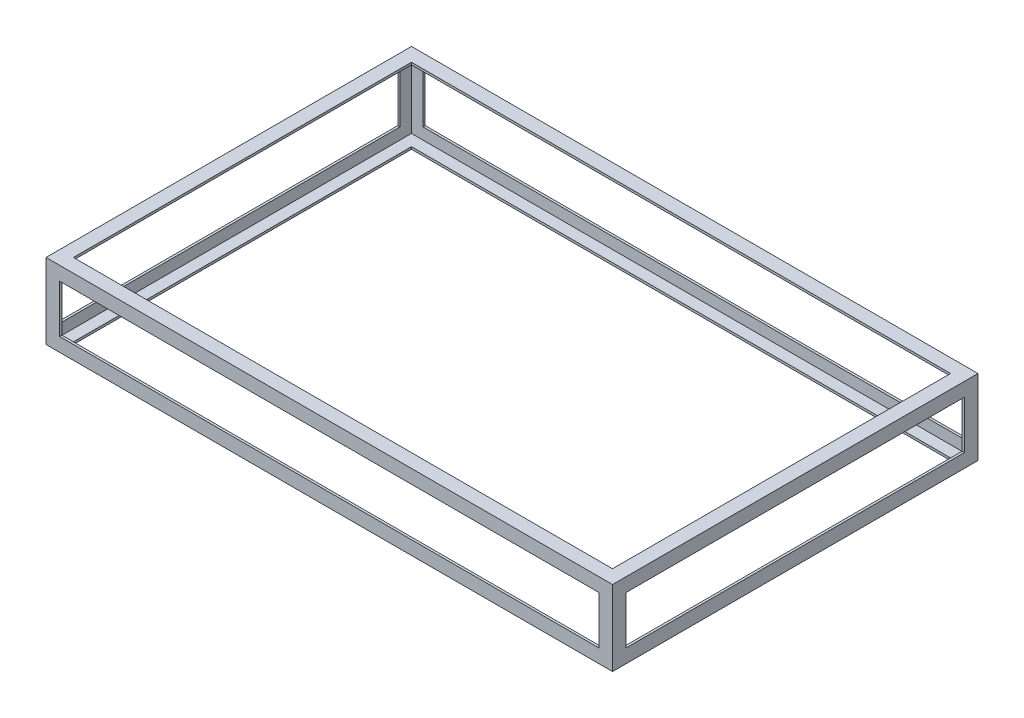
ISO-10303-21;
HEADER;
FILE_DESCRIPTION(('STEP AP214'),'2;1');
FILE_NAME('part.step','',(''),(''),'','','');
FILE_SCHEMA(('AUTOMOTIVE_DESIGN { 1 0 10303 214 1 1 1 1 }'));
ENDSEC;
DATA;
#1=APPLICATION_CONTEXT('core data for automotive mechanical design processes');
#2=APPLICATION_PROTOCOL_DEFINITION('international standard','automotive_design',2000,#1);
#3=PRODUCT_CONTEXT('',#1,'mechanical');
#4=PRODUCT('Part','Part','',(#3));
#5=PRODUCT_RELATED_PRODUCT_CATEGORY('part','',(#4));
#6=PRODUCT_DEFINITION_FORMATION('','',#4);
#7=PRODUCT_DEFINITION_CONTEXT('part definition',#1,'design');
#8=PRODUCT_DEFINITION('design','',#6,#7);
#9=PRODUCT_DEFINITION_SHAPE('','',#8);
#10=(LENGTH_UNIT() NAMED_UNIT(*) SI_UNIT(.MILLI.,.METRE.));
#11=(NAMED_UNIT(*) PLANE_ANGLE_UNIT() SI_UNIT($,.RADIAN.));
#12=(NAMED_UNIT(*) SI_UNIT($,.STERADIAN.) SOLID_ANGLE_UNIT());
#13=UNCERTAINTY_MEASURE_WITH_UNIT(LENGTH_MEASURE(1.E-05),#10,'distance_accuracy_value','');
#14=(GEOMETRIC_REPRESENTATION_CONTEXT(3) GLOBAL_UNCERTAINTY_ASSIGNED_CONTEXT((#13)) GLOBAL_UNIT_ASSIGNED_CONTEXT((#10,
#11,#12)) REPRESENTATION_CONTEXT('',''));
#15=CARTESIAN_POINT('',(0.,0.,0.));
#16=DIRECTION('',(0.,0.,1.));
#17=DIRECTION('',(1.,0.,0.));
#18=AXIS2_PLACEMENT_3D('',#15,#16,#17);
#19=CARTESIAN_POINT('',(1574.8,-304.8,469.9));
#20=DIRECTION('',(0.,0.,1.));
#21=DIRECTION('',(1.,0.,0.));
#22=AXIS2_PLACEMENT_3D('',#19,#20,#21);
#23=PLANE('',#22);
#24=DIRECTION('',(0.,1.,0.));
#25=VECTOR('',#24,1.);
#26=CARTESIAN_POINT('',(1574.8,-304.8,469.9));
#27=LINE('',#26,#25);
#28=CARTESIAN_POINT('',(1574.8,-266.699999999998,469.9));
#29=VERTEX_POINT('',#28);
#30=CARTESIAN_POINT('',(1574.8,-133.349999999999,469.9));
#31=VERTEX_POINT('',#30);
#32=EDGE_CURVE('E460',#29,#31,#27,.T.);
#33=ORIENTED_EDGE('',*,*,#32,.F.);
#34=DIRECTION('',(-1.,-2.44773580232324E-13,0.));
#35=VECTOR('',#34,1.);
#36=CARTESIAN_POINT('',(1574.79999999999,-266.699999999998,469.9));
#37=LINE('',#36,#35);
#38=CARTESIAN_POINT('',(1568.45,-266.7,469.9));
#39=VERTEX_POINT('',#38);
#40=EDGE_CURVE('E275',#29,#39,#37,.T.);
#41=ORIENTED_EDGE('',*,*,#40,.T.);
#42=DIRECTION('',(0.,-1.,0.));
#43=VECTOR('',#42,1.);
#44=CARTESIAN_POINT('',(1568.45,-95.2500000000007,469.9));
#45=LINE('',#44,#43);
#46=CARTESIAN_POINT('',(1568.45,-133.350000000001,469.9));
#47=VERTEX_POINT('',#46);
#48=EDGE_CURVE('E441',#47,#39,#45,.T.);
#49=ORIENTED_EDGE('',*,*,#48,.F.);
#50=DIRECTION('',(1.,2.27289753072872E-13,0.));
#51=VECTOR('',#50,1.);
#52=CARTESIAN_POINT('',(1574.79999999996,-133.349999999999,469.9));
#53=LINE('',#52,#51);
#54=EDGE_CURVE('E311',#47,#31,#53,.T.);
#55=ORIENTED_EDGE('',*,*,#54,.T.);
#56=EDGE_LOOP('',(#33,#41,#49,#55));
#57=FACE_BOUND('',#56,.T.);
#58=ADVANCED_FACE('F36',(#57),#23,.F.);
#59=CARTESIAN_POINT('',(1574.8,-304.8,-469.9));
#60=DIRECTION('',(0.,0.,-1.));
#61=DIRECTION('',(-1.,0.,0.));
#62=AXIS2_PLACEMENT_3D('',#59,#60,#61);
#63=PLANE('',#62);
#64=DIRECTION('',(0.,-1.,0.));
#65=VECTOR('',#64,1.);
#66=CARTESIAN_POINT('',(1568.45,-95.2500000000007,-469.9));
#67=LINE('',#66,#65);
#68=CARTESIAN_POINT('',(1568.45,-133.350000000001,-469.9));
#69=VERTEX_POINT('',#68);
#70=CARTESIAN_POINT('',(1568.45,-266.7,-469.9));
#71=VERTEX_POINT('',#70);
#72=EDGE_CURVE('E51',#69,#71,#67,.T.);
#73=ORIENTED_EDGE('',*,*,#72,.T.);
#74=DIRECTION('',(1.,2.44773580232324E-13,0.));
#75=VECTOR('',#74,1.);
#76=CARTESIAN_POINT('',(1574.79999999999,-266.699999999998,-469.9));
#77=LINE('',#76,#75);
#78=CARTESIAN_POINT('',(1574.8,-266.699999999998,-469.9));
#79=VERTEX_POINT('',#78);
#80=EDGE_CURVE('E273',#71,#79,#77,.T.);
#81=ORIENTED_EDGE('',*,*,#80,.T.);
#82=DIRECTION('',(0.,-1.,0.));
#83=VECTOR('',#82,1.);
#84=CARTESIAN_POINT('',(1574.8,-304.8,-469.9));
#85=LINE('',#84,#83);
#86=CARTESIAN_POINT('',(1574.8,-133.349999999999,-469.9));
#87=VERTEX_POINT('',#86);
#88=EDGE_CURVE('E357',#87,#79,#85,.T.);
#89=ORIENTED_EDGE('',*,*,#88,.F.);
#90=DIRECTION('',(-1.,-2.27289753072872E-13,0.));
#91=VECTOR('',#90,1.);
#92=CARTESIAN_POINT('',(1574.79999999996,-133.349999999999,-469.9));
#93=LINE('',#92,#91);
#94=EDGE_CURVE('E302',#87,#69,#93,.T.);
#95=ORIENTED_EDGE('',*,*,#94,.T.);
#96=EDGE_LOOP('',(#73,#81,#89,#95));
#97=FACE_BOUND('',#96,.T.);
#98=ADVANCED_FACE('F528',(#97),#63,.F.);
#99=DIRECTION('',(0.,-1.,0.));
#100=VECTOR('',#99,1.);
#101=CARTESIAN_POINT('',(6.35000000000008,-95.2500000000007,469.9));
#102=LINE('',#101,#100);
#103=CARTESIAN_POINT('',(6.35000000000008,-133.350000000001,469.9));
#104=VERTEX_POINT('',#103);
#105=CARTESIAN_POINT('',(6.35000000000002,-266.7,469.9));
#106=VERTEX_POINT('',#105);
#107=EDGE_CURVE('E402',#104,#106,#102,.T.);
#108=ORIENTED_EDGE('',*,*,#107,.T.);
#109=DIRECTION('',(-1.,2.44773580232317E-13,0.));
#110=VECTOR('',#109,1.);
#111=CARTESIAN_POINT('',(1574.80000000001,-266.700000000384,469.9));
#112=LINE('',#111,#110);
#113=CARTESIAN_POINT('',(0.,-266.699999999998,469.9));
#114=VERTEX_POINT('',#113);
#115=EDGE_CURVE('E295',#106,#114,#112,.T.);
#116=ORIENTED_EDGE('',*,*,#115,.T.);
#117=DIRECTION('',(0.,1.,0.));
#118=VECTOR('',#117,1.);
#119=CARTESIAN_POINT('',(0.,-304.8,469.9));
#120=LINE('',#119,#118);
#121=CARTESIAN_POINT('',(0.,-133.349999999999,469.9));
#122=VERTEX_POINT('',#121);
#123=EDGE_CURVE('E458',#114,#122,#120,.T.);
#124=ORIENTED_EDGE('',*,*,#123,.T.);
#125=DIRECTION('',(1.,-2.27289753072872E-13,0.));
#126=VECTOR('',#125,1.);
#127=CARTESIAN_POINT('',(1574.80000000004,-133.350000000357,469.9));
#128=LINE('',#127,#126);
#129=EDGE_CURVE('E388',#122,#104,#128,.T.);
#130=ORIENTED_EDGE('',*,*,#129,.T.);
#131=EDGE_LOOP('',(#108,#116,#124,#130));
#132=FACE_BOUND('',#131,.T.);
#133=ADVANCED_FACE('F504',(#132),#23,.F.);
#134=DIRECTION('',(0.,-1.,0.));
#135=VECTOR('',#134,1.);
#136=CARTESIAN_POINT('',(0.,-304.8,-469.9));
#137=LINE('',#136,#135);
#138=CARTESIAN_POINT('',(0.,-133.349999999999,-469.9));
#139=VERTEX_POINT('',#138);
#140=CARTESIAN_POINT('',(0.,-266.699999999998,-469.9));
#141=VERTEX_POINT('',#140);
#142=EDGE_CURVE('E354',#139,#141,#137,.T.);
#143=ORIENTED_EDGE('',*,*,#142,.T.);
#144=DIRECTION('',(1.,-2.44773580232317E-13,0.));
#145=VECTOR('',#144,1.);
#146=CARTESIAN_POINT('',(1574.80000000001,-266.700000000384,-469.9));
#147=LINE('',#146,#145);
#148=CARTESIAN_POINT('',(6.35000000000002,-266.7,-469.9));
#149=VERTEX_POINT('',#148);
#150=EDGE_CURVE('E292',#141,#149,#147,.T.);
#151=ORIENTED_EDGE('',*,*,#150,.T.);
#152=DIRECTION('',(0.,-1.,0.));
#153=VECTOR('',#152,1.);
#154=CARTESIAN_POINT('',(6.35000000000008,-95.2500000000007,-469.9));
#155=LINE('',#154,#153);
#156=CARTESIAN_POINT('',(6.35000000000008,-133.350000000001,-469.9));
#157=VERTEX_POINT('',#156);
#158=EDGE_CURVE('E318',#157,#149,#155,.T.);
#159=ORIENTED_EDGE('',*,*,#158,.F.);
#160=DIRECTION('',(1.,-2.27289753072872E-13,0.));
#161=VECTOR('',#160,1.);
#162=CARTESIAN_POINT('',(6.34999999999986,-133.350000000001,-469.9));
#163=LINE('',#162,#161);
#164=EDGE_CURVE('E44',#139,#157,#163,.T.);
#165=ORIENTED_EDGE('',*,*,#164,.F.);
#166=EDGE_LOOP('',(#143,#151,#159,#165));
#167=FACE_BOUND('',#166,.T.);
#168=ADVANCED_FACE('F498',(#167),#63,.F.);
#169=DIRECTION('',(-1.,0.,0.));
#170=VECTOR('',#169,1.);
#171=CARTESIAN_POINT('',(1574.8,-298.45,469.9));
#172=LINE('',#171,#170);
#173=CARTESIAN_POINT('',(1536.7,-298.45,469.9));
#174=VERTEX_POINT('',#173);
#175=CARTESIAN_POINT('',(38.1,-298.45,469.9));
#176=VERTEX_POINT('',#175);
#177=EDGE_CURVE('E462',#174,#176,#172,.T.);
#178=ORIENTED_EDGE('',*,*,#177,.F.);
#179=DIRECTION('',(0.,-1.,0.));
#180=VECTOR('',#179,1.);
#181=CARTESIAN_POINT('',(1536.7,-304.8,469.9));
#182=LINE('',#181,#180);
#183=CARTESIAN_POINT('',(1536.7,-304.799999999998,469.9));
#184=VERTEX_POINT('',#183);
#185=EDGE_CURVE('E260',#174,#184,#182,.T.);
#186=ORIENTED_EDGE('',*,*,#185,.T.);
#187=DIRECTION('',(-1.,0.,0.));
#188=VECTOR('',#187,1.);
#189=CARTESIAN_POINT('',(1574.8,-304.8,469.9));
#190=LINE('',#189,#188);
#191=CARTESIAN_POINT('',(38.1,-304.799999999998,469.9));
#192=VERTEX_POINT('',#191);
#193=EDGE_CURVE('E470',#184,#192,#190,.T.);
#194=ORIENTED_EDGE('',*,*,#193,.T.);
#195=DIRECTION('',(0.,1.,0.));
#196=VECTOR('',#195,1.);
#197=CARTESIAN_POINT('',(38.1,-304.8,469.9));
#198=LINE('',#197,#196);
#199=EDGE_CURVE('E289',#192,#176,#198,.T.);
#200=ORIENTED_EDGE('',*,*,#199,.T.);
#201=EDGE_LOOP('',(#178,#186,#194,#200));
#202=FACE_BOUND('',#201,.T.);
#203=ADVANCED_FACE('F541',(#202),#23,.F.);
#204=DIRECTION('',(-1.,0.,0.));
#205=VECTOR('',#204,1.);
#206=CARTESIAN_POINT('',(1574.8,-304.8,-469.9));
#207=LINE('',#206,#205);
#208=CARTESIAN_POINT('',(1536.7,-304.8,-469.9));
#209=VERTEX_POINT('',#208);
#210=CARTESIAN_POINT('',(38.1,-304.8,-469.9));
#211=VERTEX_POINT('',#210);
#212=EDGE_CURVE('E253',#209,#211,#207,.T.);
#213=ORIENTED_EDGE('',*,*,#212,.F.);
#214=DIRECTION('',(0.,1.,0.));
#215=VECTOR('',#214,1.);
#216=CARTESIAN_POINT('',(1536.7,-304.8,-469.9));
#217=LINE('',#216,#215);
#218=CARTESIAN_POINT('',(1536.7,-298.45,-469.9));
#219=VERTEX_POINT('',#218);
#220=EDGE_CURVE('E256',#209,#219,#217,.T.);
#221=ORIENTED_EDGE('',*,*,#220,.T.);
#222=DIRECTION('',(-1.,0.,0.));
#223=VECTOR('',#222,1.);
#224=CARTESIAN_POINT('',(1574.8,-298.45,-469.9));
#225=LINE('',#224,#223);
#226=CARTESIAN_POINT('',(38.1,-298.45,-469.9));
#227=VERTEX_POINT('',#226);
#228=EDGE_CURVE('E244',#219,#227,#225,.T.);
#229=ORIENTED_EDGE('',*,*,#228,.T.);
#230=DIRECTION('',(0.,-1.,0.));
#231=VECTOR('',#230,1.);
#232=CARTESIAN_POINT('',(38.1,-304.8,-469.9));
#233=LINE('',#232,#231);
#234=EDGE_CURVE('E281',#227,#211,#233,.T.);
#235=ORIENTED_EDGE('',*,*,#234,.T.);
#236=EDGE_LOOP('',(#213,#221,#229,#235));
#237=FACE_BOUND('',#236,.T.);
#238=ADVANCED_FACE('F257',(#237),#63,.F.);
#239=CARTESIAN_POINT('',(1574.8,-101.6,469.9));
#240=DIRECTION('',(0.,1.,0.));
#241=DIRECTION('',(0.,0.,1.));
#242=AXIS2_PLACEMENT_3D('',#239,#240,#241);
#243=PLANE('',#242);
#244=DIRECTION('',(0.,0.,1.));
#245=VECTOR('',#244,1.);
#246=CARTESIAN_POINT('',(1536.7,-101.600000000001,-561.881536726417));
#247=LINE('',#246,#245);
#248=CARTESIAN_POINT('',(1536.7,-101.600000000001,-469.9));
#249=VERTEX_POINT('',#248);
#250=CARTESIAN_POINT('',(1536.7,-101.6,469.9));
#251=VERTEX_POINT('',#250);
#252=EDGE_CURVE('E306',#249,#251,#247,.T.);
#253=ORIENTED_EDGE('',*,*,#252,.F.);
#254=DIRECTION('',(-1.,0.,0.));
#255=VECTOR('',#254,1.);
#256=CARTESIAN_POINT('',(1574.8,-101.6,-469.9));
#257=LINE('',#256,#255);
#258=CARTESIAN_POINT('',(38.1,-101.600000000001,-469.9));
#259=VERTEX_POINT('',#258);
#260=EDGE_CURVE('E339',#249,#259,#257,.T.);
#261=ORIENTED_EDGE('',*,*,#260,.T.);
#262=DIRECTION('',(0.,0.,1.));
#263=VECTOR('',#262,1.);
#264=CARTESIAN_POINT('',(38.1,-101.600000000001,-561.881536726417));
#265=LINE('',#264,#263);
#266=CARTESIAN_POINT('',(38.1,-101.600000000001,469.9));
#267=VERTEX_POINT('',#266);
#268=EDGE_CURVE('E390',#259,#267,#265,.T.);
#269=ORIENTED_EDGE('',*,*,#268,.T.);
#270=DIRECTION('',(-1.,0.,0.));
#271=VECTOR('',#270,1.);
#272=CARTESIAN_POINT('',(1574.8,-101.6,469.9));
#273=LINE('',#272,#271);
#274=EDGE_CURVE('E422',#251,#267,#273,.T.);
#275=ORIENTED_EDGE('',*,*,#274,.F.);
#276=EDGE_LOOP('',(#253,#261,#269,#275));
#277=FACE_BOUND('',#276,.T.);
#278=DIRECTION('',(0.,0.,-1.));
#279=VECTOR('',#278,1.);
#280=CARTESIAN_POINT('',(6.35000000000008,-101.6,469.900000000022));
#281=LINE('',#280,#279);
#282=CARTESIAN_POINT('',(6.35000000000052,-101.6,501.65));
#283=VERTEX_POINT('',#282);
#284=CARTESIAN_POINT('',(6.34999999998649,-101.6,-501.65));
#285=VERTEX_POINT('',#284);
#286=EDGE_CURVE('E485',#283,#285,#281,.T.);
#287=ORIENTED_EDGE('',*,*,#286,.T.);
#288=DIRECTION('',(-1.,0.,0.));
#289=VECTOR('',#288,1.);
#290=CARTESIAN_POINT('',(1574.8,-101.6,-501.65));
#291=LINE('',#290,#289);
#292=CARTESIAN_POINT('',(1568.45,-101.6,-501.65));
#293=VERTEX_POINT('',#292);
#294=EDGE_CURVE('E337',#293,#285,#291,.T.);
#295=ORIENTED_EDGE('',*,*,#294,.F.);
#296=DIRECTION('',(0.,0.,-1.));
#297=VECTOR('',#296,1.);
#298=CARTESIAN_POINT('',(1568.45,-101.6,469.9));
#299=LINE('',#298,#297);
#300=CARTESIAN_POINT('',(1568.45,-101.6,501.65));
#301=VERTEX_POINT('',#300);
#302=EDGE_CURVE('E481',#301,#293,#299,.T.);
#303=ORIENTED_EDGE('',*,*,#302,.F.);
#304=DIRECTION('',(-1.,0.,0.));
#305=VECTOR('',#304,1.);
#306=CARTESIAN_POINT('',(1574.8,-101.6,501.65));
#307=LINE('',#306,#305);
#308=EDGE_CURVE('E424',#301,#283,#307,.T.);
#309=ORIENTED_EDGE('',*,*,#308,.T.);
#310=EDGE_LOOP('',(#287,#295,#303,#309));
#311=FACE_BOUND('',#310,.T.);
#312=ADVANCED_FACE('F560',(#277,#311),#243,.F.);
#313=CARTESIAN_POINT('',(6.35000000000008,-95.2500000000007,469.9));
#314=DIRECTION('',(1.,0.,0.));
#315=DIRECTION('',(0.,0.,-1.));
#316=AXIS2_PLACEMENT_3D('',#313,#314,#315);
#317=PLANE('',#316);
#318=DIRECTION('',(0.,0.,1.));
#319=VECTOR('',#318,1.);
#320=CARTESIAN_POINT('',(6.35000000000002,-266.7,-561.881536726417));
#321=LINE('',#320,#319);
#322=EDGE_CURVE('E282',#149,#106,#321,.T.);
#323=ORIENTED_EDGE('',*,*,#322,.T.);
#324=ORIENTED_EDGE('',*,*,#107,.F.);
#325=DIRECTION('',(0.,0.,1.));
#326=VECTOR('',#325,1.);
#327=CARTESIAN_POINT('',(6.34999999999986,-133.350000000001,-561.881536726417));
#328=LINE('',#327,#326);
#329=EDGE_CURVE('E393',#157,#104,#328,.T.);
#330=ORIENTED_EDGE('',*,*,#329,.F.);
#331=ORIENTED_EDGE('',*,*,#158,.T.);
#332=EDGE_LOOP('',(#323,#324,#330,#331));
#333=FACE_BOUND('',#332,.T.);
#334=DIRECTION('',(0.,0.,1.));
#335=VECTOR('',#334,1.);
#336=CARTESIAN_POINT('',(6.35000000000008,-298.45,469.900000000022));
#337=LINE('',#336,#335);
#338=CARTESIAN_POINT('',(6.35000000000052,-298.45,-501.65));
#339=VERTEX_POINT('',#338);
#340=CARTESIAN_POINT('',(6.3500000000003,-298.45,501.65));
#341=VERTEX_POINT('',#340);
#342=EDGE_CURVE('E406',#339,#341,#337,.T.);
#343=ORIENTED_EDGE('',*,*,#342,.F.);
#344=DIRECTION('',(0.,-1.,0.));
#345=VECTOR('',#344,1.);
#346=CARTESIAN_POINT('',(6.35000000000052,-95.2500000000007,-501.65));
#347=LINE('',#346,#345);
#348=EDGE_CURVE('E322',#285,#339,#347,.T.);
#349=ORIENTED_EDGE('',*,*,#348,.F.);
#350=ORIENTED_EDGE('',*,*,#286,.F.);
#351=DIRECTION('',(0.,-1.,0.));
#352=VECTOR('',#351,1.);
#353=CARTESIAN_POINT('',(6.35000000000052,-95.2500000000007,501.65));
#354=LINE('',#353,#352);
#355=EDGE_CURVE('E410',#283,#341,#354,.T.);
#356=ORIENTED_EDGE('',*,*,#355,.T.);
#357=EDGE_LOOP('',(#343,#349,#350,#356));
#358=FACE_BOUND('',#357,.T.);
#359=ADVANCED_FACE('F500',(#333,#358),#317,.T.);
#360=CARTESIAN_POINT('',(38.1,-95.2499999999992,-561.881536726417));
#361=DIRECTION('',(1.,0.,0.));
#362=DIRECTION('',(0.,0.,-1.));
#363=AXIS2_PLACEMENT_3D('',#360,#361,#362);
#364=PLANE('',#363);
#365=ORIENTED_EDGE('',*,*,#268,.F.);
#366=DIRECTION('',(0.,1.,0.));
#367=VECTOR('',#366,1.);
#368=CARTESIAN_POINT('',(38.1,-95.2499999999992,-469.9));
#369=LINE('',#368,#367);
#370=CARTESIAN_POINT('',(38.1,-95.2499999999992,-469.9));
#371=VERTEX_POINT('',#370);
#372=EDGE_CURVE('E378',#259,#371,#369,.T.);
#373=ORIENTED_EDGE('',*,*,#372,.T.);
#374=DIRECTION('',(0.,0.,1.));
#375=VECTOR('',#374,1.);
#376=CARTESIAN_POINT('',(38.1,-95.2499999999992,-561.881536726417));
#377=LINE('',#376,#375);
#378=CARTESIAN_POINT('',(38.1,-95.2499999999992,469.9));
#379=VERTEX_POINT('',#378);
#380=EDGE_CURVE('E386',#371,#379,#377,.T.);
#381=ORIENTED_EDGE('',*,*,#380,.T.);
#382=DIRECTION('',(0.,1.,0.));
#383=VECTOR('',#382,1.);
#384=CARTESIAN_POINT('',(38.1,-304.8,469.9));
#385=LINE('',#384,#383);
#386=EDGE_CURVE('E399',#267,#379,#385,.T.);
#387=ORIENTED_EDGE('',*,*,#386,.F.);
#388=EDGE_LOOP('',(#365,#373,#381,#387));
#389=FACE_BOUND('',#388,.T.);
#390=ADVANCED_FACE('F618',(#389),#364,.T.);
#391=CARTESIAN_POINT('',(6.34999999999986,-133.350000000001,-561.881536726417));
#392=DIRECTION('',(-2.27289753072872E-13,-1.,0.));
#393=DIRECTION('',(1.,-2.27289753072872E-13,0.));
#394=AXIS2_PLACEMENT_3D('',#391,#392,#393);
#395=PLANE('',#394);
#396=DIRECTION('',(0.,0.,1.));
#397=VECTOR('',#396,1.);
#398=CARTESIAN_POINT('',(0.,-133.349999999999,-561.881536726417));
#399=LINE('',#398,#397);
#400=EDGE_CURVE('E381',#139,#122,#399,.T.);
#401=ORIENTED_EDGE('',*,*,#400,.F.);
#402=ORIENTED_EDGE('',*,*,#164,.T.);
#403=ORIENTED_EDGE('',*,*,#329,.T.);
#404=ORIENTED_EDGE('',*,*,#129,.F.);
#405=EDGE_LOOP('',(#401,#402,#403,#404));
#406=FACE_BOUND('',#405,.T.);
#407=ADVANCED_FACE('F494',(#406),#395,.T.);
#408=CARTESIAN_POINT('',(1574.8,-298.45,501.65));
#409=DIRECTION('',(0.,0.,1.));
#410=DIRECTION('',(1.,0.,0.));
#411=AXIS2_PLACEMENT_3D('',#408,#409,#410);
#412=PLANE('',#411);
#413=DIRECTION('',(0.,-1.,0.));
#414=VECTOR('',#413,1.);
#415=CARTESIAN_POINT('',(38.1,-95.2500000000007,501.65));
#416=LINE('',#415,#414);
#417=CARTESIAN_POINT('',(38.1,-133.35,501.65));
#418=VERTEX_POINT('',#417);
#419=CARTESIAN_POINT('',(38.1,-266.7,501.65));
#420=VERTEX_POINT('',#419);
#421=EDGE_CURVE('E407',#418,#420,#416,.T.);
#422=ORIENTED_EDGE('',*,*,#421,.T.);
#423=DIRECTION('',(-1.,0.,0.));
#424=VECTOR('',#423,1.);
#425=CARTESIAN_POINT('',(1574.8,-266.7,501.65));
#426=LINE('',#425,#424);
#427=CARTESIAN_POINT('',(1536.7,-266.7,501.65));
#428=VERTEX_POINT('',#427);
#429=EDGE_CURVE('E477',#428,#420,#426,.T.);
#430=ORIENTED_EDGE('',*,*,#429,.F.);
#431=DIRECTION('',(0.,-1.,0.));
#432=VECTOR('',#431,1.);
#433=CARTESIAN_POINT('',(1536.7,-95.2500000000007,501.65));
#434=LINE('',#433,#432);
#435=CARTESIAN_POINT('',(1536.7,-133.35,501.65));
#436=VERTEX_POINT('',#435);
#437=EDGE_CURVE('E447',#436,#428,#434,.T.);
#438=ORIENTED_EDGE('',*,*,#437,.F.);
#439=DIRECTION('',(-1.,0.,0.));
#440=VECTOR('',#439,1.);
#441=CARTESIAN_POINT('',(1574.8,-133.35,501.65));
#442=LINE('',#441,#440);
#443=EDGE_CURVE('E426',#436,#418,#442,.T.);
#444=ORIENTED_EDGE('',*,*,#443,.T.);
#445=EDGE_LOOP('',(#422,#430,#438,#444));
#446=FACE_BOUND('',#445,.T.);
#447=DIRECTION('',(-1.,0.,0.));
#448=VECTOR('',#447,1.);
#449=CARTESIAN_POINT('',(1574.8,-298.45,501.65));
#450=LINE('',#449,#448);
#451=CARTESIAN_POINT('',(1568.45,-298.45,501.65));
#452=VERTEX_POINT('',#451);
#453=EDGE_CURVE('E479',#452,#341,#450,.T.);
#454=ORIENTED_EDGE('',*,*,#453,.T.);
#455=ORIENTED_EDGE('',*,*,#355,.F.);
#456=ORIENTED_EDGE('',*,*,#308,.F.);
#457=DIRECTION('',(0.,-1.,0.));
#458=VECTOR('',#457,1.);
#459=CARTESIAN_POINT('',(1568.45,-95.2500000000007,501.65));
#460=LINE('',#459,#458);
#461=EDGE_CURVE('E445',#301,#452,#460,.T.);
#462=ORIENTED_EDGE('',*,*,#461,.T.);
#463=EDGE_LOOP('',(#454,#455,#456,#462));
#464=FACE_BOUND('',#463,.T.);
#465=ADVANCED_FACE('F601',(#446,#464),#412,.F.);
#466=CARTESIAN_POINT('',(1536.7,-95.2500000000007,501.65));
#467=DIRECTION('',(-1.,0.,0.));
#468=DIRECTION('',(0.,0.,1.));
#469=AXIS2_PLACEMENT_3D('',#466,#467,#468);
#470=PLANE('',#469);
#471=DIRECTION('',(0.,-1.,0.));
#472=VECTOR('',#471,1.);
#473=CARTESIAN_POINT('',(1536.7,-95.2500000000007,508.));
#474=LINE('',#473,#472);
#475=CARTESIAN_POINT('',(1536.7,-133.35,508.));
#476=VERTEX_POINT('',#475);
#477=CARTESIAN_POINT('',(1536.7,-266.7,508.));
#478=VERTEX_POINT('',#477);
#479=EDGE_CURVE('E440',#476,#478,#474,.T.);
#480=ORIENTED_EDGE('',*,*,#479,.F.);
#481=DIRECTION('',(0.,0.,-1.));
#482=VECTOR('',#481,1.);
#483=CARTESIAN_POINT('',(1536.7,-133.35,501.65));
#484=LINE('',#483,#482);
#485=EDGE_CURVE('E483',#476,#436,#484,.T.);
#486=ORIENTED_EDGE('',*,*,#485,.T.);
#487=ORIENTED_EDGE('',*,*,#437,.T.);
#488=DIRECTION('',(0.,0.,-1.));
#489=VECTOR('',#488,1.);
#490=CARTESIAN_POINT('',(1536.7,-266.7,501.65));
#491=LINE('',#490,#489);
#492=EDGE_CURVE('E451',#478,#428,#491,.T.);
#493=ORIENTED_EDGE('',*,*,#492,.F.);
#494=EDGE_LOOP('',(#480,#486,#487,#493));
#495=FACE_BOUND('',#494,.T.);
#496=ADVANCED_FACE('F605',(#495),#470,.T.);
#497=CARTESIAN_POINT('',(1568.45,-95.2500000000007,469.9));
#498=DIRECTION('',(-1.,0.,0.));
#499=DIRECTION('',(0.,0.,1.));
#500=AXIS2_PLACEMENT_3D('',#497,#498,#499);
#501=PLANE('',#500);
#502=DIRECTION('',(0.,-1.,0.));
#503=VECTOR('',#502,1.);
#504=CARTESIAN_POINT('',(1568.45,-95.2500000000007,-501.65));
#505=LINE('',#504,#503);
#506=CARTESIAN_POINT('',(1568.45,-298.45,-501.65));
#507=VERTEX_POINT('',#506);
#508=EDGE_CURVE('E343',#293,#507,#505,.T.);
#509=ORIENTED_EDGE('',*,*,#508,.T.);
#510=DIRECTION('',(0.,0.,-1.));
#511=VECTOR('',#510,1.);
#512=CARTESIAN_POINT('',(1568.45,-298.45,469.9));
#513=LINE('',#512,#511);
#514=EDGE_CURVE('E444',#452,#507,#513,.T.);
#515=ORIENTED_EDGE('',*,*,#514,.F.);
#516=ORIENTED_EDGE('',*,*,#461,.F.);
#517=ORIENTED_EDGE('',*,*,#302,.T.);
#518=EDGE_LOOP('',(#509,#515,#516,#517));
#519=FACE_BOUND('',#518,.T.);
#520=ORIENTED_EDGE('',*,*,#48,.T.);
#521=DIRECTION('',(0.,0.,1.));
#522=VECTOR('',#521,1.);
#523=CARTESIAN_POINT('',(1568.45,-266.7,-561.881536726417));
#524=LINE('',#523,#522);
#525=EDGE_CURVE('E261',#71,#39,#524,.T.);
#526=ORIENTED_EDGE('',*,*,#525,.F.);
#527=ORIENTED_EDGE('',*,*,#72,.F.);
#528=DIRECTION('',(0.,0.,1.));
#529=VECTOR('',#528,1.);
#530=CARTESIAN_POINT('',(1568.45,-133.350000000001,-561.881536726417));
#531=LINE('',#530,#529);
#532=EDGE_CURVE('E303',#69,#47,#531,.T.);
#533=ORIENTED_EDGE('',*,*,#532,.T.);
#534=EDGE_LOOP('',(#520,#526,#527,#533));
#535=FACE_BOUND('',#534,.T.);
#536=ADVANCED_FACE('F611',(#519,#535),#501,.T.);
#537=CARTESIAN_POINT('',(1574.8,-298.45,469.9));
#538=DIRECTION('',(0.,-1.,0.));
#539=DIRECTION('',(0.,0.,-1.));
#540=AXIS2_PLACEMENT_3D('',#537,#538,#539);
#541=PLANE('',#540);
#542=DIRECTION('',(0.,0.,1.));
#543=VECTOR('',#542,1.);
#544=CARTESIAN_POINT('',(1536.7,-298.45,-561.881536726417));
#545=LINE('',#544,#543);
#546=EDGE_CURVE('E59',#219,#174,#545,.T.);
#547=ORIENTED_EDGE('',*,*,#546,.T.);
#548=ORIENTED_EDGE('',*,*,#177,.T.);
#549=DIRECTION('',(0.,0.,1.));
#550=VECTOR('',#549,1.);
#551=CARTESIAN_POINT('',(38.1,-298.45,-561.881536726417));
#552=LINE('',#551,#550);
#553=EDGE_CURVE('E248',#227,#176,#552,.T.);
#554=ORIENTED_EDGE('',*,*,#553,.F.);
#555=ORIENTED_EDGE('',*,*,#228,.F.);
#556=EDGE_LOOP('',(#547,#548,#554,#555));
#557=FACE_BOUND('',#556,.T.);
#558=ORIENTED_EDGE('',*,*,#342,.T.);
#559=ORIENTED_EDGE('',*,*,#453,.F.);
#560=ORIENTED_EDGE('',*,*,#514,.T.);
#561=DIRECTION('',(-1.,0.,0.));
#562=VECTOR('',#561,1.);
#563=CARTESIAN_POINT('',(1574.8,-298.45,-501.65));
#564=LINE('',#563,#562);
#565=EDGE_CURVE('E252',#507,#339,#564,.T.);
#566=ORIENTED_EDGE('',*,*,#565,.T.);
#567=EDGE_LOOP('',(#558,#559,#560,#566));
#568=FACE_BOUND('',#567,.T.);
#569=ADVANCED_FACE('F38',(#557,#568),#541,.F.);
#570=CARTESIAN_POINT('',(1574.8,-266.7,501.65));
#571=DIRECTION('',(0.,-1.,0.));
#572=DIRECTION('',(0.,0.,-1.));
#573=AXIS2_PLACEMENT_3D('',#570,#571,#572);
#574=PLANE('',#573);
#575=ORIENTED_EDGE('',*,*,#429,.T.);
#576=DIRECTION('',(0.,0.,1.));
#577=VECTOR('',#576,1.);
#578=CARTESIAN_POINT('',(38.1,-266.7,501.65));
#579=LINE('',#578,#577);
#580=CARTESIAN_POINT('',(38.1,-266.7,508.));
#581=VERTEX_POINT('',#580);
#582=EDGE_CURVE('E417',#420,#581,#579,.T.);
#583=ORIENTED_EDGE('',*,*,#582,.T.);
#584=DIRECTION('',(-1.,0.,0.));
#585=VECTOR('',#584,1.);
#586=CARTESIAN_POINT('',(1574.8,-266.7,508.));
#587=LINE('',#586,#585);
#588=EDGE_CURVE('E474',#478,#581,#587,.T.);
#589=ORIENTED_EDGE('',*,*,#588,.F.);
#590=ORIENTED_EDGE('',*,*,#492,.T.);
#591=EDGE_LOOP('',(#575,#583,#589,#590));
#592=FACE_BOUND('',#591,.T.);
#593=ADVANCED_FACE('F585',(#592),#574,.F.);
#594=CARTESIAN_POINT('',(1574.8,-304.8,508.));
#595=DIRECTION('',(0.,0.,-1.));
#596=DIRECTION('',(0.,1.,0.));
#597=AXIS2_PLACEMENT_3D('',#594,#595,#596);
#598=PLANE('',#597);
#599=DIRECTION('',(-1.,0.,0.));
#600=VECTOR('',#599,1.);
#601=CARTESIAN_POINT('',(1574.8,-304.8,508.));
#602=LINE('',#601,#600);
#603=CARTESIAN_POINT('',(1574.8,-304.8,508.));
#604=VERTEX_POINT('',#603);
#605=CARTESIAN_POINT('',(0.,-304.8,508.));
#606=VERTEX_POINT('',#605);
#607=EDGE_CURVE('E472',#604,#606,#602,.T.);
#608=ORIENTED_EDGE('',*,*,#607,.F.);
#609=DIRECTION('',(0.,-1.,0.));
#610=VECTOR('',#609,1.);
#611=CARTESIAN_POINT('',(1574.8,-304.8,508.));
#612=LINE('',#611,#610);
#613=CARTESIAN_POINT('',(1574.8,-95.2500000000007,508.));
#614=VERTEX_POINT('',#613);
#615=EDGE_CURVE('E455',#614,#604,#612,.T.);
#616=ORIENTED_EDGE('',*,*,#615,.F.);
#617=DIRECTION('',(-1.,0.,0.));
#618=VECTOR('',#617,1.);
#619=CARTESIAN_POINT('',(1574.8,-95.2500000000007,508.));
#620=LINE('',#619,#618);
#621=CARTESIAN_POINT('',(0.,-95.2500000000002,508.));
#622=VERTEX_POINT('',#621);
#623=EDGE_CURVE('E432',#614,#622,#620,.T.);
#624=ORIENTED_EDGE('',*,*,#623,.T.);
#625=DIRECTION('',(0.,-1.,0.));
#626=VECTOR('',#625,1.);
#627=CARTESIAN_POINT('',(0.,-304.8,508.));
#628=LINE('',#627,#626);
#629=EDGE_CURVE('E454',#622,#606,#628,.T.);
#630=ORIENTED_EDGE('',*,*,#629,.T.);
#631=EDGE_LOOP('',(#608,#616,#624,#630));
#632=FACE_BOUND('',#631,.T.);
#633=ORIENTED_EDGE('',*,*,#588,.T.);
#634=DIRECTION('',(0.,-1.,0.));
#635=VECTOR('',#634,1.);
#636=CARTESIAN_POINT('',(38.1,-95.2500000000007,508.));
#637=LINE('',#636,#635);
#638=CARTESIAN_POINT('',(38.1,-133.35,508.));
#639=VERTEX_POINT('',#638);
#640=EDGE_CURVE('E403',#639,#581,#637,.T.);
#641=ORIENTED_EDGE('',*,*,#640,.F.);
#642=DIRECTION('',(-1.,0.,0.));
#643=VECTOR('',#642,1.);
#644=CARTESIAN_POINT('',(1574.8,-133.35,508.));
#645=LINE('',#644,#643);
#646=EDGE_CURVE('E429',#476,#639,#645,.T.);
#647=ORIENTED_EDGE('',*,*,#646,.F.);
#648=ORIENTED_EDGE('',*,*,#479,.T.);
#649=EDGE_LOOP('',(#633,#641,#647,#648));
#650=FACE_BOUND('',#649,.T.);
#651=ADVANCED_FACE('F552',(#632,#650),#598,.F.);
#652=CARTESIAN_POINT('',(1574.8,-304.8,508.));
#653=DIRECTION('',(0.,1.,0.));
#654=DIRECTION('',(0.,0.,1.));
#655=AXIS2_PLACEMENT_3D('',#652,#653,#654);
#656=PLANE('',#655);
#657=ORIENTED_EDGE('',*,*,#193,.F.);
#658=DIRECTION('',(0.,0.,1.));
#659=VECTOR('',#658,1.);
#660=CARTESIAN_POINT('',(1536.7,-304.799999999998,-561.881536726417));
#661=LINE('',#660,#659);
#662=EDGE_CURVE('E266',#209,#184,#661,.T.);
#663=ORIENTED_EDGE('',*,*,#662,.F.);
#664=ORIENTED_EDGE('',*,*,#212,.T.);
#665=DIRECTION('',(0.,0.,1.));
#666=VECTOR('',#665,1.);
#667=CARTESIAN_POINT('',(38.1,-304.799999999998,-561.881536726417));
#668=LINE('',#667,#666);
#669=EDGE_CURVE('E278',#211,#192,#668,.T.);
#670=ORIENTED_EDGE('',*,*,#669,.T.);
#671=EDGE_LOOP('',(#657,#663,#664,#670));
#672=FACE_BOUND('',#671,.T.);
#673=DIRECTION('',(0.,0.,-1.));
#674=VECTOR('',#673,1.);
#675=CARTESIAN_POINT('',(0.,-304.8,508.));
#676=LINE('',#675,#674);
#677=CARTESIAN_POINT('',(0.,-304.8,-508.));
#678=VERTEX_POINT('',#677);
#679=EDGE_CURVE('E465',#606,#678,#676,.T.);
#680=ORIENTED_EDGE('',*,*,#679,.T.);
#681=DIRECTION('',(-1.,0.,0.));
#682=VECTOR('',#681,1.);
#683=CARTESIAN_POINT('',(1574.8,-304.8,-508.));
#684=LINE('',#683,#682);
#685=CARTESIAN_POINT('',(1574.8,-304.8,-508.));
#686=VERTEX_POINT('',#685);
#687=EDGE_CURVE('E360',#686,#678,#684,.T.);
#688=ORIENTED_EDGE('',*,*,#687,.F.);
#689=DIRECTION('',(0.,0.,-1.));
#690=VECTOR('',#689,1.);
#691=CARTESIAN_POINT('',(1574.8,-304.8,508.));
#692=LINE('',#691,#690);
#693=EDGE_CURVE('E457',#604,#686,#692,.T.);
#694=ORIENTED_EDGE('',*,*,#693,.F.);
#695=ORIENTED_EDGE('',*,*,#607,.T.);
#696=EDGE_LOOP('',(#680,#688,#694,#695));
#697=FACE_BOUND('',#696,.T.);
#698=ADVANCED_FACE('F544',(#672,#697),#656,.F.);
#699=DIRECTION('',(1.,0.,0.));
#700=VECTOR('',#699,1.);
#701=CARTESIAN_POINT('',(1574.8,-95.2500000000007,469.9));
#702=LINE('',#701,#700);
#703=CARTESIAN_POINT('',(1536.7,-95.2499999999992,469.9));
#704=VERTEX_POINT('',#703);
#705=EDGE_CURVE('E434',#379,#704,#702,.T.);
#706=ORIENTED_EDGE('',*,*,#705,.T.);
#707=DIRECTION('',(0.,-1.,0.));
#708=VECTOR('',#707,1.);
#709=CARTESIAN_POINT('',(1536.7,-304.8,469.9));
#710=LINE('',#709,#708);
#711=EDGE_CURVE('E314',#704,#251,#710,.T.);
#712=ORIENTED_EDGE('',*,*,#711,.T.);
#713=ORIENTED_EDGE('',*,*,#274,.T.);
#714=ORIENTED_EDGE('',*,*,#386,.T.);
#715=EDGE_LOOP('',(#706,#712,#713,#714));
#716=FACE_BOUND('',#715,.T.);
#717=ADVANCED_FACE('F531',(#716),#23,.F.);
#718=CARTESIAN_POINT('',(1574.8,0.,0.));
#719=DIRECTION('',(-1.,0.,0.));
#720=DIRECTION('',(0.,0.,1.));
#721=AXIS2_PLACEMENT_3D('',#718,#719,#720);
#722=PLANE('',#721);
#723=DIRECTION('',(0.,0.,1.));
#724=VECTOR('',#723,1.);
#725=CARTESIAN_POINT('',(1574.8,-266.699999999998,-561.881536726417));
#726=LINE('',#725,#724);
#727=EDGE_CURVE('E268',#79,#29,#726,.T.);
#728=ORIENTED_EDGE('',*,*,#727,.T.);
#729=ORIENTED_EDGE('',*,*,#32,.T.);
#730=DIRECTION('',(0.,0.,1.));
#731=VECTOR('',#730,1.);
#732=CARTESIAN_POINT('',(1574.8,-133.349999999999,-561.881536726417));
#733=LINE('',#732,#731);
#734=EDGE_CURVE('E299',#87,#31,#733,.T.);
#735=ORIENTED_EDGE('',*,*,#734,.F.);
#736=ORIENTED_EDGE('',*,*,#88,.T.);
#737=EDGE_LOOP('',(#728,#729,#735,#736));
#738=FACE_BOUND('',#737,.T.);
#739=ORIENTED_EDGE('',*,*,#615,.T.);
#740=ORIENTED_EDGE('',*,*,#693,.T.);
#741=DIRECTION('',(0.,1.,0.));
#742=VECTOR('',#741,1.);
#743=CARTESIAN_POINT('',(1574.8,-304.8,-508.));
#744=LINE('',#743,#742);
#745=CARTESIAN_POINT('',(1574.8,-95.2500000000007,-508.));
#746=VERTEX_POINT('',#745);
#747=EDGE_CURVE('E355',#686,#746,#744,.T.);
#748=ORIENTED_EDGE('',*,*,#747,.T.);
#749=DIRECTION('',(0.,0.,1.));
#750=VECTOR('',#749,1.);
#751=CARTESIAN_POINT('',(1574.8,-95.2500000000007,508.));
#752=LINE('',#751,#750);
#753=EDGE_CURVE('E437',#746,#614,#752,.T.);
#754=ORIENTED_EDGE('',*,*,#753,.T.);
#755=EDGE_LOOP('',(#739,#740,#748,#754));
#756=FACE_BOUND('',#755,.T.);
#757=ADVANCED_FACE('F543',(#738,#756),#722,.F.);
#758=CARTESIAN_POINT('',(0.,0.,0.));
#759=DIRECTION('',(-1.,0.,0.));
#760=DIRECTION('',(0.,0.,1.));
#761=AXIS2_PLACEMENT_3D('',#758,#759,#760);
#762=PLANE('',#761);
#763=ORIENTED_EDGE('',*,*,#123,.F.);
#764=DIRECTION('',(0.,0.,1.));
#765=VECTOR('',#764,1.);
#766=CARTESIAN_POINT('',(0.,-266.699999999998,-561.881536726417));
#767=LINE('',#766,#765);
#768=EDGE_CURVE('E279',#141,#114,#767,.T.);
#769=ORIENTED_EDGE('',*,*,#768,.F.);
#770=ORIENTED_EDGE('',*,*,#142,.F.);
#771=ORIENTED_EDGE('',*,*,#400,.T.);
#772=EDGE_LOOP('',(#763,#769,#770,#771));
#773=FACE_BOUND('',#772,.T.);
#774=DIRECTION('',(0.,1.,0.));
#775=VECTOR('',#774,1.);
#776=CARTESIAN_POINT('',(0.,-133.349999999999,-508.000000000001));
#777=LINE('',#776,#775);
#778=CARTESIAN_POINT('',(0.,-95.2499999999991,-508.000000000001));
#779=VERTEX_POINT('',#778);
#780=EDGE_CURVE('E385',#678,#779,#777,.T.);
#781=ORIENTED_EDGE('',*,*,#780,.F.);
#782=ORIENTED_EDGE('',*,*,#679,.F.);
#783=ORIENTED_EDGE('',*,*,#629,.F.);
#784=DIRECTION('',(0.,0.,1.));
#785=VECTOR('',#784,1.);
#786=CARTESIAN_POINT('',(0.,-95.2500000000002,508.));
#787=LINE('',#786,#785);
#788=EDGE_CURVE('E419',#779,#622,#787,.T.);
#789=ORIENTED_EDGE('',*,*,#788,.F.);
#790=EDGE_LOOP('',(#781,#782,#783,#789));
#791=FACE_BOUND('',#790,.T.);
#792=ADVANCED_FACE('F508',(#773,#791),#762,.T.);
#793=CARTESIAN_POINT('',(0.,-95.2500000000007,0.));
#794=DIRECTION('',(0.,1.,0.));
#795=DIRECTION('',(0.,0.,1.));
#796=AXIS2_PLACEMENT_3D('',#793,#794,#795);
#797=PLANE('',#796);
#798=DIRECTION('',(0.,0.,1.));
#799=VECTOR('',#798,1.);
#800=CARTESIAN_POINT('',(1536.7,-95.2499999999992,-561.881536726417));
#801=LINE('',#800,#799);
#802=CARTESIAN_POINT('',(1536.7,-95.2500000000007,-469.9));
#803=VERTEX_POINT('',#802);
#804=EDGE_CURVE('E298',#803,#704,#801,.T.);
#805=ORIENTED_EDGE('',*,*,#804,.T.);
#806=ORIENTED_EDGE('',*,*,#705,.F.);
#807=ORIENTED_EDGE('',*,*,#380,.F.);
#808=DIRECTION('',(-1.,0.,0.));
#809=VECTOR('',#808,1.);
#810=CARTESIAN_POINT('',(1574.8,-95.2500000000007,-469.9));
#811=LINE('',#810,#809);
#812=EDGE_CURVE('E341',#803,#371,#811,.T.);
#813=ORIENTED_EDGE('',*,*,#812,.F.);
#814=EDGE_LOOP('',(#805,#806,#807,#813));
#815=FACE_BOUND('',#814,.T.);
#816=ORIENTED_EDGE('',*,*,#753,.F.);
#817=DIRECTION('',(1.,0.,0.));
#818=VECTOR('',#817,1.);
#819=CARTESIAN_POINT('',(0.,-95.2499999999991,-508.000000000001));
#820=LINE('',#819,#818);
#821=EDGE_CURVE('E382',#779,#746,#820,.T.);
#822=ORIENTED_EDGE('',*,*,#821,.F.);
#823=ORIENTED_EDGE('',*,*,#788,.T.);
#824=ORIENTED_EDGE('',*,*,#623,.F.);
#825=EDGE_LOOP('',(#816,#822,#823,#824));
#826=FACE_BOUND('',#825,.T.);
#827=ADVANCED_FACE('F581',(#815,#826),#797,.T.);
#828=CARTESIAN_POINT('',(1574.8,-133.35,501.65));
#829=DIRECTION('',(0.,1.,0.));
#830=DIRECTION('',(0.,0.,1.));
#831=AXIS2_PLACEMENT_3D('',#828,#829,#830);
#832=PLANE('',#831);
#833=ORIENTED_EDGE('',*,*,#646,.T.);
#834=DIRECTION('',(0.,0.,-1.));
#835=VECTOR('',#834,1.);
#836=CARTESIAN_POINT('',(38.1,-133.35,501.65));
#837=LINE('',#836,#835);
#838=EDGE_CURVE('E488',#639,#418,#837,.T.);
#839=ORIENTED_EDGE('',*,*,#838,.T.);
#840=ORIENTED_EDGE('',*,*,#443,.F.);
#841=ORIENTED_EDGE('',*,*,#485,.F.);
#842=EDGE_LOOP('',(#833,#839,#840,#841));
#843=FACE_BOUND('',#842,.T.);
#844=ADVANCED_FACE('F597',(#843),#832,.F.);
#845=CARTESIAN_POINT('',(38.1,-95.2500000000007,501.65));
#846=DIRECTION('',(1.,0.,0.));
#847=DIRECTION('',(0.,0.,-1.));
#848=AXIS2_PLACEMENT_3D('',#845,#846,#847);
#849=PLANE('',#848);
#850=ORIENTED_EDGE('',*,*,#582,.F.);
#851=ORIENTED_EDGE('',*,*,#421,.F.);
#852=ORIENTED_EDGE('',*,*,#838,.F.);
#853=ORIENTED_EDGE('',*,*,#640,.T.);
#854=EDGE_LOOP('',(#850,#851,#852,#853));
#855=FACE_BOUND('',#854,.T.);
#856=ADVANCED_FACE('F594',(#855),#849,.T.);
#857=CARTESIAN_POINT('',(1574.8,-304.8,-508.));
#858=DIRECTION('',(0.,0.,1.));
#859=DIRECTION('',(0.,-1.,0.));
#860=AXIS2_PLACEMENT_3D('',#857,#858,#859);
#861=PLANE('',#860);
#862=ORIENTED_EDGE('',*,*,#687,.T.);
#863=ORIENTED_EDGE('',*,*,#780,.T.);
#864=ORIENTED_EDGE('',*,*,#821,.T.);
#865=ORIENTED_EDGE('',*,*,#747,.F.);
#866=EDGE_LOOP('',(#862,#863,#864,#865));
#867=FACE_BOUND('',#866,.T.);
#868=DIRECTION('',(0.,-1.,0.));
#869=VECTOR('',#868,1.);
#870=CARTESIAN_POINT('',(38.1,-95.2500000000007,-507.999999999999));
#871=LINE('',#870,#869);
#872=CARTESIAN_POINT('',(38.1,-133.35,-508.));
#873=VERTEX_POINT('',#872);
#874=CARTESIAN_POINT('',(38.1,-266.7,-507.999999999999));
#875=VERTEX_POINT('',#874);
#876=EDGE_CURVE('E317',#873,#875,#871,.T.);
#877=ORIENTED_EDGE('',*,*,#876,.T.);
#878=DIRECTION('',(-1.,0.,0.));
#879=VECTOR('',#878,1.);
#880=CARTESIAN_POINT('',(1574.8,-266.7,-508.));
#881=LINE('',#880,#879);
#882=CARTESIAN_POINT('',(1536.7,-266.7,-507.999999999999));
#883=VERTEX_POINT('',#882);
#884=EDGE_CURVE('E369',#883,#875,#881,.T.);
#885=ORIENTED_EDGE('',*,*,#884,.F.);
#886=DIRECTION('',(0.,-1.,0.));
#887=VECTOR('',#886,1.);
#888=CARTESIAN_POINT('',(1536.7,-95.2500000000007,-507.999999999999));
#889=LINE('',#888,#887);
#890=CARTESIAN_POINT('',(1536.7,-133.35,-508.));
#891=VERTEX_POINT('',#890);
#892=EDGE_CURVE('E346',#891,#883,#889,.T.);
#893=ORIENTED_EDGE('',*,*,#892,.F.);
#894=DIRECTION('',(-1.,0.,0.));
#895=VECTOR('',#894,1.);
#896=CARTESIAN_POINT('',(1574.8,-133.35,-508.));
#897=LINE('',#896,#895);
#898=EDGE_CURVE('E331',#891,#873,#897,.T.);
#899=ORIENTED_EDGE('',*,*,#898,.T.);
#900=EDGE_LOOP('',(#877,#885,#893,#899));
#901=FACE_BOUND('',#900,.T.);
#902=ADVANCED_FACE('F575',(#867,#901),#861,.F.);
#903=CARTESIAN_POINT('',(1574.8,-298.45,-501.65));
#904=DIRECTION('',(0.,0.,-1.));
#905=DIRECTION('',(-1.,0.,0.));
#906=AXIS2_PLACEMENT_3D('',#903,#904,#905);
#907=PLANE('',#906);
#908=DIRECTION('',(0.,-1.,0.));
#909=VECTOR('',#908,1.);
#910=CARTESIAN_POINT('',(38.1,-95.2500000000007,-501.649999999999));
#911=LINE('',#910,#909);
#912=CARTESIAN_POINT('',(38.1,-133.35,-501.649999999999));
#913=VERTEX_POINT('',#912);
#914=CARTESIAN_POINT('',(38.1,-266.7,-501.649999999999));
#915=VERTEX_POINT('',#914);
#916=EDGE_CURVE('E325',#913,#915,#911,.T.);
#917=ORIENTED_EDGE('',*,*,#916,.F.);
#918=DIRECTION('',(-1.,0.,0.));
#919=VECTOR('',#918,1.);
#920=CARTESIAN_POINT('',(1574.8,-133.35,-501.65));
#921=LINE('',#920,#919);
#922=CARTESIAN_POINT('',(1536.7,-133.35,-501.649999999999));
#923=VERTEX_POINT('',#922);
#924=EDGE_CURVE('E334',#923,#913,#921,.T.);
#925=ORIENTED_EDGE('',*,*,#924,.F.);
#926=DIRECTION('',(0.,-1.,0.));
#927=VECTOR('',#926,1.);
#928=CARTESIAN_POINT('',(1536.7,-95.2500000000007,-501.649999999999));
#929=LINE('',#928,#927);
#930=CARTESIAN_POINT('',(1536.7,-266.7,-501.649999999999));
#931=VERTEX_POINT('',#930);
#932=EDGE_CURVE('E348',#923,#931,#929,.T.);
#933=ORIENTED_EDGE('',*,*,#932,.T.);
#934=DIRECTION('',(-1.,0.,0.));
#935=VECTOR('',#934,1.);
#936=CARTESIAN_POINT('',(1574.8,-266.7,-501.65));
#937=LINE('',#936,#935);
#938=EDGE_CURVE('E366',#931,#915,#937,.T.);
#939=ORIENTED_EDGE('',*,*,#938,.T.);
#940=EDGE_LOOP('',(#917,#925,#933,#939));
#941=FACE_BOUND('',#940,.T.);
#942=ORIENTED_EDGE('',*,*,#294,.T.);
#943=ORIENTED_EDGE('',*,*,#348,.T.);
#944=ORIENTED_EDGE('',*,*,#565,.F.);
#945=ORIENTED_EDGE('',*,*,#508,.F.);
#946=EDGE_LOOP('',(#942,#943,#944,#945));
#947=FACE_BOUND('',#946,.T.);
#948=ADVANCED_FACE('F664',(#941,#947),#907,.F.);
#949=CARTESIAN_POINT('',(1536.7,-95.2500000000007,-501.649999999999));
#950=DIRECTION('',(-1.,0.,0.));
#951=DIRECTION('',(0.,0.,1.));
#952=AXIS2_PLACEMENT_3D('',#949,#950,#951);
#953=PLANE('',#952);
#954=ORIENTED_EDGE('',*,*,#932,.F.);
#955=DIRECTION('',(0.,0.,-1.));
#956=VECTOR('',#955,1.);
#957=CARTESIAN_POINT('',(1536.7,-133.35,-501.649999999999));
#958=LINE('',#957,#956);
#959=EDGE_CURVE('E372',#923,#891,#958,.T.);
#960=ORIENTED_EDGE('',*,*,#959,.T.);
#961=ORIENTED_EDGE('',*,*,#892,.T.);
#962=DIRECTION('',(0.,0.,-1.));
#963=VECTOR('',#962,1.);
#964=CARTESIAN_POINT('',(1536.7,-266.7,-501.65));
#965=LINE('',#964,#963);
#966=EDGE_CURVE('E345',#931,#883,#965,.T.);
#967=ORIENTED_EDGE('',*,*,#966,.F.);
#968=EDGE_LOOP('',(#954,#960,#961,#967));
#969=FACE_BOUND('',#968,.T.);
#970=ADVANCED_FACE('F670',(#969),#953,.T.);
#971=CARTESIAN_POINT('',(1574.8,-266.7,-501.65));
#972=DIRECTION('',(0.,-1.,0.));
#973=DIRECTION('',(0.,0.,-1.));
#974=AXIS2_PLACEMENT_3D('',#971,#972,#973);
#975=PLANE('',#974);
#976=ORIENTED_EDGE('',*,*,#884,.T.);
#977=DIRECTION('',(0.,0.,1.));
#978=VECTOR('',#977,1.);
#979=CARTESIAN_POINT('',(38.1,-266.7,-501.65));
#980=LINE('',#979,#978);
#981=EDGE_CURVE('E321',#875,#915,#980,.T.);
#982=ORIENTED_EDGE('',*,*,#981,.T.);
#983=ORIENTED_EDGE('',*,*,#938,.F.);
#984=ORIENTED_EDGE('',*,*,#966,.T.);
#985=EDGE_LOOP('',(#976,#982,#983,#984));
#986=FACE_BOUND('',#985,.T.);
#987=ADVANCED_FACE('F678',(#986),#975,.F.);
#988=ORIENTED_EDGE('',*,*,#260,.F.);
#989=DIRECTION('',(0.,1.,0.));
#990=VECTOR('',#989,1.);
#991=CARTESIAN_POINT('',(1536.7,-304.8,-469.9));
#992=LINE('',#991,#990);
#993=EDGE_CURVE('E11',#249,#803,#992,.T.);
#994=ORIENTED_EDGE('',*,*,#993,.T.);
#995=ORIENTED_EDGE('',*,*,#812,.T.);
#996=ORIENTED_EDGE('',*,*,#372,.F.);
#997=EDGE_LOOP('',(#988,#994,#995,#996));
#998=FACE_BOUND('',#997,.T.);
#999=ADVANCED_FACE('F536',(#998),#63,.F.);
#1000=CARTESIAN_POINT('',(1574.8,-133.35,-501.65));
#1001=DIRECTION('',(0.,1.,0.));
#1002=DIRECTION('',(0.,0.,1.));
#1003=AXIS2_PLACEMENT_3D('',#1000,#1001,#1002);
#1004=PLANE('',#1003);
#1005=ORIENTED_EDGE('',*,*,#924,.T.);
#1006=DIRECTION('',(0.,0.,-1.));
#1007=VECTOR('',#1006,1.);
#1008=CARTESIAN_POINT('',(38.1,-133.35,-501.65));
#1009=LINE('',#1008,#1007);
#1010=EDGE_CURVE('E375',#913,#873,#1009,.T.);
#1011=ORIENTED_EDGE('',*,*,#1010,.T.);
#1012=ORIENTED_EDGE('',*,*,#898,.F.);
#1013=ORIENTED_EDGE('',*,*,#959,.F.);
#1014=EDGE_LOOP('',(#1005,#1011,#1012,#1013));
#1015=FACE_BOUND('',#1014,.T.);
#1016=ADVANCED_FACE('F693',(#1015),#1004,.F.);
#1017=CARTESIAN_POINT('',(38.1,-95.2500000000007,-501.649999999999));
#1018=DIRECTION('',(1.,0.,0.));
#1019=DIRECTION('',(0.,0.,-1.));
#1020=AXIS2_PLACEMENT_3D('',#1017,#1018,#1019);
#1021=PLANE('',#1020);
#1022=ORIENTED_EDGE('',*,*,#981,.F.);
#1023=ORIENTED_EDGE('',*,*,#876,.F.);
#1024=ORIENTED_EDGE('',*,*,#1010,.F.);
#1025=ORIENTED_EDGE('',*,*,#916,.T.);
#1026=EDGE_LOOP('',(#1022,#1023,#1024,#1025));
#1027=FACE_BOUND('',#1026,.T.);
#1028=ADVANCED_FACE('F700',(#1027),#1021,.T.);
#1029=CARTESIAN_POINT('',(1536.7,-95.2499999999992,-561.881536726417));
#1030=DIRECTION('',(-1.,0.,0.));
#1031=DIRECTION('',(0.,0.,1.));
#1032=AXIS2_PLACEMENT_3D('',#1029,#1030,#1031);
#1033=PLANE('',#1032);
#1034=ORIENTED_EDGE('',*,*,#711,.F.);
#1035=ORIENTED_EDGE('',*,*,#804,.F.);
#1036=ORIENTED_EDGE('',*,*,#993,.F.);
#1037=ORIENTED_EDGE('',*,*,#252,.T.);
#1038=EDGE_LOOP('',(#1034,#1035,#1036,#1037));
#1039=FACE_BOUND('',#1038,.T.);
#1040=ADVANCED_FACE('F523',(#1039),#1033,.T.);
#1041=CARTESIAN_POINT('',(1568.45,-133.350000000001,-561.881536726417));
#1042=DIRECTION('',(2.27289753072872E-13,-1.,0.));
#1043=DIRECTION('',(1.,2.27289753072872E-13,0.));
#1044=AXIS2_PLACEMENT_3D('',#1041,#1042,#1043);
#1045=PLANE('',#1044);
#1046=ORIENTED_EDGE('',*,*,#54,.F.);
#1047=ORIENTED_EDGE('',*,*,#532,.F.);
#1048=ORIENTED_EDGE('',*,*,#94,.F.);
#1049=ORIENTED_EDGE('',*,*,#734,.T.);
#1050=EDGE_LOOP('',(#1046,#1047,#1048,#1049));
#1051=FACE_BOUND('',#1050,.T.);
#1052=ADVANCED_FACE('F514',(#1051),#1045,.T.);
#1053=CARTESIAN_POINT('',(6.35000000000002,-266.7,-561.881536726417));
#1054=DIRECTION('',(2.44773580232317E-13,1.,0.));
#1055=DIRECTION('',(-1.,2.44773580232317E-13,0.));
#1056=AXIS2_PLACEMENT_3D('',#1053,#1054,#1055);
#1057=PLANE('',#1056);
#1058=ORIENTED_EDGE('',*,*,#115,.F.);
#1059=ORIENTED_EDGE('',*,*,#322,.F.);
#1060=ORIENTED_EDGE('',*,*,#150,.F.);
#1061=ORIENTED_EDGE('',*,*,#768,.T.);
#1062=EDGE_LOOP('',(#1058,#1059,#1060,#1061));
#1063=FACE_BOUND('',#1062,.T.);
#1064=ADVANCED_FACE('F511',(#1063),#1057,.T.);
#1065=CARTESIAN_POINT('',(38.1,-304.799999999998,-561.881536726417));
#1066=DIRECTION('',(1.,0.,0.));
#1067=DIRECTION('',(0.,0.,-1.));
#1068=AXIS2_PLACEMENT_3D('',#1065,#1066,#1067);
#1069=PLANE('',#1068);
#1070=ORIENTED_EDGE('',*,*,#199,.F.);
#1071=ORIENTED_EDGE('',*,*,#669,.F.);
#1072=ORIENTED_EDGE('',*,*,#234,.F.);
#1073=ORIENTED_EDGE('',*,*,#553,.T.);
#1074=EDGE_LOOP('',(#1070,#1071,#1072,#1073));
#1075=FACE_BOUND('',#1074,.T.);
#1076=ADVANCED_FACE('F513',(#1075),#1069,.T.);
#1077=CARTESIAN_POINT('',(1568.45,-266.7,-561.881536726417));
#1078=DIRECTION('',(-2.44773580232324E-13,1.,0.));
#1079=DIRECTION('',(-1.,-2.44773580232324E-13,0.));
#1080=AXIS2_PLACEMENT_3D('',#1077,#1078,#1079);
#1081=PLANE('',#1080);
#1082=ORIENTED_EDGE('',*,*,#40,.F.);
#1083=ORIENTED_EDGE('',*,*,#727,.F.);
#1084=ORIENTED_EDGE('',*,*,#80,.F.);
#1085=ORIENTED_EDGE('',*,*,#525,.T.);
#1086=EDGE_LOOP('',(#1082,#1083,#1084,#1085));
#1087=FACE_BOUND('',#1086,.T.);
#1088=ADVANCED_FACE('F520',(#1087),#1081,.T.);
#1089=CARTESIAN_POINT('',(1536.7,-304.799999999998,-561.881536726417));
#1090=DIRECTION('',(-1.,0.,0.));
#1091=DIRECTION('',(0.,0.,1.));
#1092=AXIS2_PLACEMENT_3D('',#1089,#1090,#1091);
#1093=PLANE('',#1092);
#1094=ORIENTED_EDGE('',*,*,#185,.F.);
#1095=ORIENTED_EDGE('',*,*,#546,.F.);
#1096=ORIENTED_EDGE('',*,*,#220,.F.);
#1097=ORIENTED_EDGE('',*,*,#662,.T.);
#1098=EDGE_LOOP('',(#1094,#1095,#1096,#1097));
#1099=FACE_BOUND('',#1098,.T.);
#1100=ADVANCED_FACE('F263',(#1099),#1093,.T.);
#1101=CLOSED_SHELL('',(#58,#98,#133,#168,#203,#238,#312,#359,#390,#407,#465,#496,#536,#569,#593,
#651,#698,#717,#757,#792,#827,#844,#856,#902,#948,#970,#987,#999,#1016,#1028,#1040,#1052,#1064,
#1076,#1088,#1100));
#1102=MANIFOLD_SOLID_BREP('B2',#1101);
#1103=ADVANCED_BREP_SHAPE_REPRESENTATION('',(#18,#1102),#14);
#1104=SHAPE_DEFINITION_REPRESENTATION(#9,#1103);
ENDSEC;
END-ISO-10303-21;
